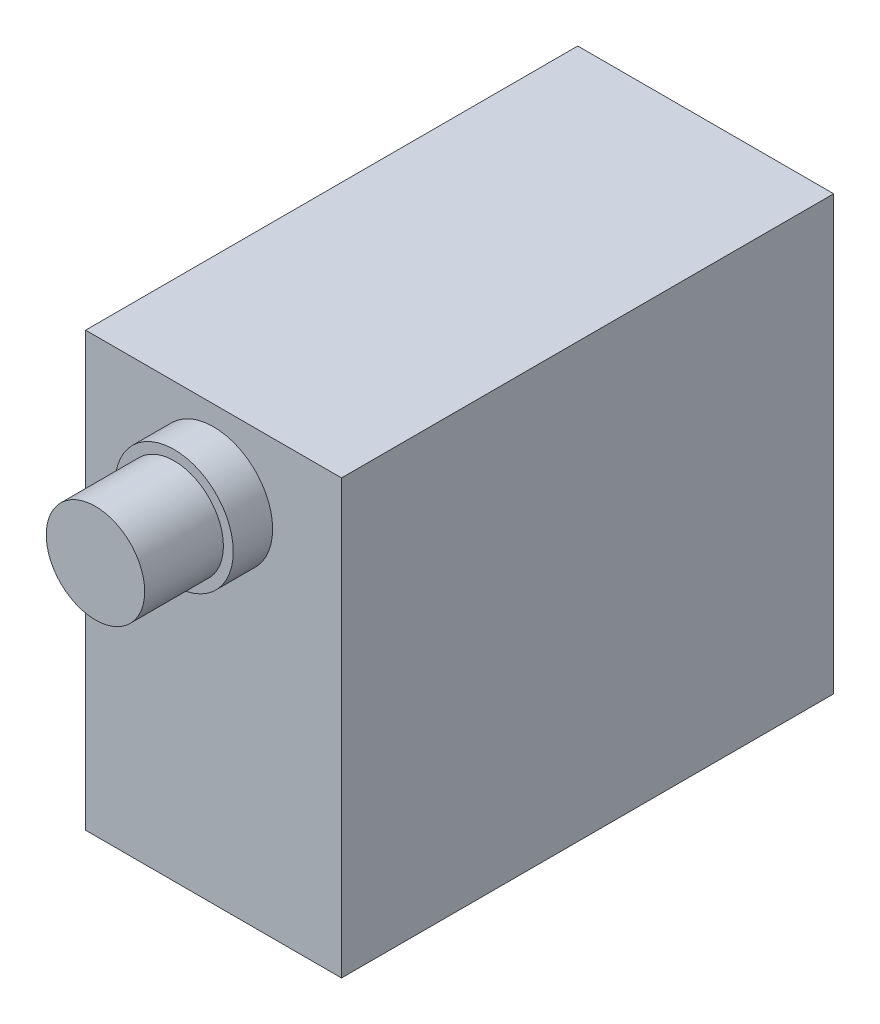
ISO-10303-21;
HEADER;
FILE_DESCRIPTION(('STEP AP214'),'2;1');
FILE_NAME('part.step','',(''),(''),'','','');
FILE_SCHEMA(('AUTOMOTIVE_DESIGN { 1 0 10303 214 1 1 1 1 }'));
ENDSEC;
DATA;
#1=APPLICATION_CONTEXT('core data for automotive mechanical design processes');
#2=APPLICATION_PROTOCOL_DEFINITION('international standard','automotive_design',2000,#1);
#3=PRODUCT_CONTEXT('',#1,'mechanical');
#4=PRODUCT('Part','Part','',(#3));
#5=PRODUCT_RELATED_PRODUCT_CATEGORY('part','',(#4));
#6=PRODUCT_DEFINITION_FORMATION('','',#4);
#7=PRODUCT_DEFINITION_CONTEXT('part definition',#1,'design');
#8=PRODUCT_DEFINITION('design','',#6,#7);
#9=PRODUCT_DEFINITION_SHAPE('','',#8);
#10=(LENGTH_UNIT() NAMED_UNIT(*) SI_UNIT(.MILLI.,.METRE.));
#11=(NAMED_UNIT(*) PLANE_ANGLE_UNIT() SI_UNIT($,.RADIAN.));
#12=(NAMED_UNIT(*) SI_UNIT($,.STERADIAN.) SOLID_ANGLE_UNIT());
#13=UNCERTAINTY_MEASURE_WITH_UNIT(LENGTH_MEASURE(1.E-05),#10,'distance_accuracy_value','');
#14=(GEOMETRIC_REPRESENTATION_CONTEXT(3) GLOBAL_UNCERTAINTY_ASSIGNED_CONTEXT((#13)) GLOBAL_UNIT_ASSIGNED_CONTEXT((#10,
#11,#12)) REPRESENTATION_CONTEXT('',''));
#15=CARTESIAN_POINT('',(0.,0.,0.));
#16=DIRECTION('',(0.,0.,1.));
#17=DIRECTION('',(1.,0.,0.));
#18=AXIS2_PLACEMENT_3D('',#15,#16,#17);
#19=CARTESIAN_POINT('',(-6.5,-11.,25.));
#20=DIRECTION('',(1.,0.,0.));
#21=DIRECTION('',(0.,0.,-1.));
#22=AXIS2_PLACEMENT_3D('',#19,#20,#21);
#23=PLANE('',#22);
#24=DIRECTION('',(0.,-1.,0.));
#25=VECTOR('',#24,1.);
#26=CARTESIAN_POINT('',(-6.5,-11.,0.));
#27=LINE('',#26,#25);
#28=CARTESIAN_POINT('',(-6.5,11.,0.));
#29=VERTEX_POINT('',#28);
#30=CARTESIAN_POINT('',(-6.5,-11.,0.));
#31=VERTEX_POINT('',#30);
#32=EDGE_CURVE('E105',#29,#31,#27,.T.);
#33=ORIENTED_EDGE('',*,*,#32,.T.);
#34=DIRECTION('',(0.,0.,-1.));
#35=VECTOR('',#34,1.);
#36=CARTESIAN_POINT('',(-6.5,-11.,25.));
#37=LINE('',#36,#35);
#38=CARTESIAN_POINT('',(-6.5,-11.,25.));
#39=VERTEX_POINT('',#38);
#40=EDGE_CURVE('E42',#39,#31,#37,.T.);
#41=ORIENTED_EDGE('',*,*,#40,.F.);
#42=DIRECTION('',(0.,-1.,0.));
#43=VECTOR('',#42,1.);
#44=CARTESIAN_POINT('',(-6.5,-11.,25.));
#45=LINE('',#44,#43);
#46=CARTESIAN_POINT('',(-6.5,11.,25.));
#47=VERTEX_POINT('',#46);
#48=EDGE_CURVE('E92',#47,#39,#45,.T.);
#49=ORIENTED_EDGE('',*,*,#48,.F.);
#50=DIRECTION('',(0.,0.,-1.));
#51=VECTOR('',#50,1.);
#52=CARTESIAN_POINT('',(-6.5,11.,25.));
#53=LINE('',#52,#51);
#54=EDGE_CURVE('E101',#47,#29,#53,.T.);
#55=ORIENTED_EDGE('',*,*,#54,.T.);
#56=EDGE_LOOP('',(#33,#41,#49,#55));
#57=FACE_BOUND('',#56,.T.);
#58=ADVANCED_FACE('F39',(#57),#23,.F.);
#59=CARTESIAN_POINT('',(6.5,-11.,25.));
#60=DIRECTION('',(0.,1.,0.));
#61=DIRECTION('',(-1.,0.,0.));
#62=AXIS2_PLACEMENT_3D('',#59,#60,#61);
#63=PLANE('',#62);
#64=DIRECTION('',(1.,0.,0.));
#65=VECTOR('',#64,1.);
#66=CARTESIAN_POINT('',(6.5,-11.,0.));
#67=LINE('',#66,#65);
#68=CARTESIAN_POINT('',(6.5,-11.,0.));
#69=VERTEX_POINT('',#68);
#70=EDGE_CURVE('E97',#31,#69,#67,.T.);
#71=ORIENTED_EDGE('',*,*,#70,.T.);
#72=DIRECTION('',(0.,0.,-1.));
#73=VECTOR('',#72,1.);
#74=CARTESIAN_POINT('',(6.5,-11.,25.));
#75=LINE('',#74,#73);
#76=CARTESIAN_POINT('',(6.5,-11.,25.));
#77=VERTEX_POINT('',#76);
#78=EDGE_CURVE('E95',#77,#69,#75,.T.);
#79=ORIENTED_EDGE('',*,*,#78,.F.);
#80=DIRECTION('',(1.,0.,0.));
#81=VECTOR('',#80,1.);
#82=CARTESIAN_POINT('',(6.5,-11.,25.));
#83=LINE('',#82,#81);
#84=EDGE_CURVE('E87',#39,#77,#83,.T.);
#85=ORIENTED_EDGE('',*,*,#84,.F.);
#86=ORIENTED_EDGE('',*,*,#40,.T.);
#87=EDGE_LOOP('',(#71,#79,#85,#86));
#88=FACE_BOUND('',#87,.T.);
#89=ADVANCED_FACE('F96',(#88),#63,.F.);
#90=CARTESIAN_POINT('',(6.5,-11.,25.));
#91=DIRECTION('',(-1.,0.,0.));
#92=DIRECTION('',(0.,0.,1.));
#93=AXIS2_PLACEMENT_3D('',#90,#91,#92);
#94=PLANE('',#93);
#95=DIRECTION('',(0.,1.,0.));
#96=VECTOR('',#95,1.);
#97=CARTESIAN_POINT('',(6.5,-11.,0.));
#98=LINE('',#97,#96);
#99=CARTESIAN_POINT('',(6.5,11.,0.));
#100=VERTEX_POINT('',#99);
#101=EDGE_CURVE('E73',#69,#100,#98,.T.);
#102=ORIENTED_EDGE('',*,*,#101,.T.);
#103=DIRECTION('',(0.,0.,-1.));
#104=VECTOR('',#103,1.);
#105=CARTESIAN_POINT('',(6.5,11.,25.));
#106=LINE('',#105,#104);
#107=CARTESIAN_POINT('',(6.5,11.,25.));
#108=VERTEX_POINT('',#107);
#109=EDGE_CURVE('E98',#108,#100,#106,.T.);
#110=ORIENTED_EDGE('',*,*,#109,.F.);
#111=DIRECTION('',(0.,1.,0.));
#112=VECTOR('',#111,1.);
#113=CARTESIAN_POINT('',(6.5,-11.,25.));
#114=LINE('',#113,#112);
#115=EDGE_CURVE('E90',#77,#108,#114,.T.);
#116=ORIENTED_EDGE('',*,*,#115,.F.);
#117=ORIENTED_EDGE('',*,*,#78,.T.);
#118=EDGE_LOOP('',(#102,#110,#116,#117));
#119=FACE_BOUND('',#118,.T.);
#120=ADVANCED_FACE('F99',(#119),#94,.F.);
#121=CARTESIAN_POINT('',(6.5,11.,25.));
#122=DIRECTION('',(0.,-1.,0.));
#123=DIRECTION('',(0.,0.,-1.));
#124=AXIS2_PLACEMENT_3D('',#121,#122,#123);
#125=PLANE('',#124);
#126=DIRECTION('',(-1.,0.,0.));
#127=VECTOR('',#126,1.);
#128=CARTESIAN_POINT('',(6.5,11.,0.));
#129=LINE('',#128,#127);
#130=EDGE_CURVE('E79',#100,#29,#129,.T.);
#131=ORIENTED_EDGE('',*,*,#130,.T.);
#132=ORIENTED_EDGE('',*,*,#54,.F.);
#133=DIRECTION('',(-1.,0.,0.));
#134=VECTOR('',#133,1.);
#135=CARTESIAN_POINT('',(6.5,11.,25.));
#136=LINE('',#135,#134);
#137=EDGE_CURVE('E56',#108,#47,#136,.T.);
#138=ORIENTED_EDGE('',*,*,#137,.F.);
#139=ORIENTED_EDGE('',*,*,#109,.T.);
#140=EDGE_LOOP('',(#131,#132,#138,#139));
#141=FACE_BOUND('',#140,.T.);
#142=ADVANCED_FACE('F113',(#141),#125,.F.);
#143=CARTESIAN_POINT('',(0.,0.,25.));
#144=DIRECTION('',(0.,0.,1.));
#145=DIRECTION('',(1.,0.,0.));
#146=AXIS2_PLACEMENT_3D('',#143,#144,#145);
#147=PLANE('',#146);
#148=CARTESIAN_POINT('',(0.,7.,25.));
#149=DIRECTION('',(0.,0.,1.));
#150=DIRECTION('',(1.,0.,0.));
#151=AXIS2_PLACEMENT_3D('',#148,#149,#150);
#152=CIRCLE('',#151,3.);
#153=CARTESIAN_POINT('',(3.,7.,25.));
#154=VERTEX_POINT('',#153);
#155=EDGE_CURVE('E119',#154,#154,#152,.T.);
#156=ORIENTED_EDGE('',*,*,#155,.F.);
#157=EDGE_LOOP('',(#156));
#158=FACE_BOUND('',#157,.T.);
#159=ORIENTED_EDGE('',*,*,#48,.T.);
#160=ORIENTED_EDGE('',*,*,#84,.T.);
#161=ORIENTED_EDGE('',*,*,#115,.T.);
#162=ORIENTED_EDGE('',*,*,#137,.T.);
#163=EDGE_LOOP('',(#159,#160,#161,#162));
#164=FACE_BOUND('',#163,.T.);
#165=ADVANCED_FACE('F88',(#158,#164),#147,.T.);
#166=CARTESIAN_POINT('',(0.,0.,0.));
#167=DIRECTION('',(0.,0.,1.));
#168=DIRECTION('',(1.,0.,0.));
#169=AXIS2_PLACEMENT_3D('',#166,#167,#168);
#170=PLANE('',#169);
#171=ORIENTED_EDGE('',*,*,#32,.F.);
#172=ORIENTED_EDGE('',*,*,#130,.F.);
#173=ORIENTED_EDGE('',*,*,#101,.F.);
#174=ORIENTED_EDGE('',*,*,#70,.F.);
#175=EDGE_LOOP('',(#171,#172,#173,#174));
#176=FACE_BOUND('',#175,.T.);
#177=ADVANCED_FACE('F116',(#176),#170,.F.);
#178=CARTESIAN_POINT('',(0.,7.,27.));
#179=DIRECTION('',(0.,0.,-1.));
#180=DIRECTION('',(-1.,0.,0.));
#181=AXIS2_PLACEMENT_3D('',#178,#179,#180);
#182=CYLINDRICAL_SURFACE('',#181,3.);
#183=CARTESIAN_POINT('',(0.,7.,27.));
#184=DIRECTION('',(0.,0.,1.));
#185=DIRECTION('',(1.,0.,0.));
#186=AXIS2_PLACEMENT_3D('',#183,#184,#185);
#187=CIRCLE('',#186,3.);
#188=CARTESIAN_POINT('',(3.,7.,27.));
#189=VERTEX_POINT('',#188);
#190=EDGE_CURVE('E108',#189,#189,#187,.T.);
#191=ORIENTED_EDGE('',*,*,#190,.F.);
#192=EDGE_LOOP('',(#191));
#193=FACE_BOUND('',#192,.T.);
#194=ORIENTED_EDGE('',*,*,#155,.T.);
#195=EDGE_LOOP('',(#194));
#196=FACE_BOUND('',#195,.T.);
#197=ADVANCED_FACE('F139',(#193,#196),#182,.T.);
#198=CARTESIAN_POINT('',(0.,7.,27.));
#199=DIRECTION('',(0.,0.,1.));
#200=DIRECTION('',(1.,0.,0.));
#201=AXIS2_PLACEMENT_3D('',#198,#199,#200);
#202=PLANE('',#201);
#203=CARTESIAN_POINT('',(0.,7.,27.));
#204=DIRECTION('',(0.,0.,1.));
#205=DIRECTION('',(1.,0.,0.));
#206=AXIS2_PLACEMENT_3D('',#203,#204,#205);
#207=CIRCLE('',#206,2.5);
#208=CARTESIAN_POINT('',(2.5,7.,27.));
#209=VERTEX_POINT('',#208);
#210=EDGE_CURVE('E11',#209,#209,#207,.T.);
#211=ORIENTED_EDGE('',*,*,#210,.F.);
#212=EDGE_LOOP('',(#211));
#213=FACE_BOUND('',#212,.T.);
#214=ORIENTED_EDGE('',*,*,#190,.T.);
#215=EDGE_LOOP('',(#214));
#216=FACE_BOUND('',#215,.T.);
#217=ADVANCED_FACE('F133',(#213,#216),#202,.T.);
#218=CARTESIAN_POINT('',(0.,7.,31.));
#219=DIRECTION('',(0.,0.,-1.));
#220=DIRECTION('',(-1.,0.,0.));
#221=AXIS2_PLACEMENT_3D('',#218,#219,#220);
#222=CYLINDRICAL_SURFACE('',#221,2.5);
#223=CARTESIAN_POINT('',(0.,7.,31.));
#224=DIRECTION('',(0.,0.,1.));
#225=DIRECTION('',(1.,0.,0.));
#226=AXIS2_PLACEMENT_3D('',#223,#224,#225);
#227=CIRCLE('',#226,2.5);
#228=CARTESIAN_POINT('',(2.5,7.,31.));
#229=VERTEX_POINT('',#228);
#230=EDGE_CURVE('E122',#229,#229,#227,.T.);
#231=ORIENTED_EDGE('',*,*,#230,.F.);
#232=EDGE_LOOP('',(#231));
#233=FACE_BOUND('',#232,.T.);
#234=ORIENTED_EDGE('',*,*,#210,.T.);
#235=EDGE_LOOP('',(#234));
#236=FACE_BOUND('',#235,.T.);
#237=ADVANCED_FACE('F130',(#233,#236),#222,.T.);
#238=CARTESIAN_POINT('',(0.,7.,31.));
#239=DIRECTION('',(0.,0.,1.));
#240=DIRECTION('',(1.,0.,0.));
#241=AXIS2_PLACEMENT_3D('',#238,#239,#240);
#242=PLANE('',#241);
#243=ORIENTED_EDGE('',*,*,#230,.T.);
#244=EDGE_LOOP('',(#243));
#245=FACE_BOUND('',#244,.T.);
#246=ADVANCED_FACE('F128',(#245),#242,.T.);
#247=CLOSED_SHELL('',(#58,#89,#120,#142,#165,#177,#197,#217,#237,#246));
#248=MANIFOLD_SOLID_BREP('B2',#247);
#249=ADVANCED_BREP_SHAPE_REPRESENTATION('',(#18,#248),#14);
#250=SHAPE_DEFINITION_REPRESENTATION(#9,#249);
ENDSEC;
END-ISO-10303-21;
